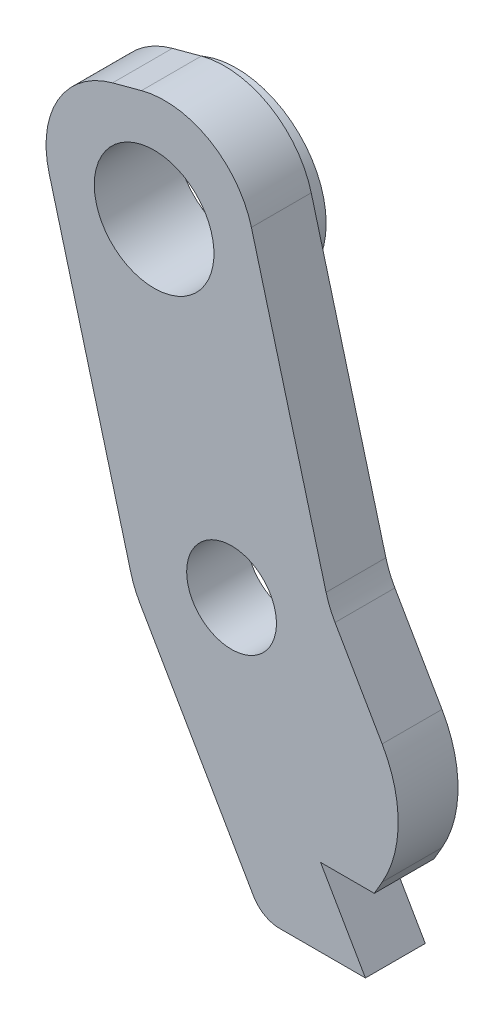
ISO-10303-21;
HEADER;
FILE_DESCRIPTION(('STEP AP214'),'2;1');
FILE_NAME('part.step','',(''),(''),'','','');
FILE_SCHEMA(('AUTOMOTIVE_DESIGN { 1 0 10303 214 1 1 1 1 }'));
ENDSEC;
DATA;
#1=APPLICATION_CONTEXT('core data for automotive mechanical design processes');
#2=APPLICATION_PROTOCOL_DEFINITION('international standard','automotive_design',2000,#1);
#3=PRODUCT_CONTEXT('',#1,'mechanical');
#4=PRODUCT('Part','Part','',(#3));
#5=PRODUCT_RELATED_PRODUCT_CATEGORY('part','',(#4));
#6=PRODUCT_DEFINITION_FORMATION('','',#4);
#7=PRODUCT_DEFINITION_CONTEXT('part definition',#1,'design');
#8=PRODUCT_DEFINITION('design','',#6,#7);
#9=PRODUCT_DEFINITION_SHAPE('','',#8);
#10=(LENGTH_UNIT() NAMED_UNIT(*) SI_UNIT(.MILLI.,.METRE.));
#11=(NAMED_UNIT(*) PLANE_ANGLE_UNIT() SI_UNIT($,.RADIAN.));
#12=(NAMED_UNIT(*) SI_UNIT($,.STERADIAN.) SOLID_ANGLE_UNIT());
#13=UNCERTAINTY_MEASURE_WITH_UNIT(LENGTH_MEASURE(1.E-05),#10,'distance_accuracy_value','');
#14=(GEOMETRIC_REPRESENTATION_CONTEXT(3) GLOBAL_UNCERTAINTY_ASSIGNED_CONTEXT((#13)) GLOBAL_UNIT_ASSIGNED_CONTEXT((#10,
#11,#12)) REPRESENTATION_CONTEXT('',''));
#15=CARTESIAN_POINT('',(0.,0.,0.));
#16=DIRECTION('',(0.,0.,1.));
#17=DIRECTION('',(1.,0.,0.));
#18=AXIS2_PLACEMENT_3D('',#15,#16,#17);
#19=CARTESIAN_POINT('',(0.,0.,-37.2524640543525));
#20=DIRECTION('',(0.,0.,-1.));
#21=DIRECTION('',(-1.,0.,0.));
#22=AXIS2_PLACEMENT_3D('',#19,#20,#21);
#23=PLANE('',#22);
#24=CARTESIAN_POINT('',(-16.5877555472492,18.6593747845128,-37.2524640543525));
#25=DIRECTION('',(0.,0.,-1.));
#26=DIRECTION('',(-1.,0.,0.));
#27=AXIS2_PLACEMENT_3D('',#24,#25,#26);
#28=CIRCLE('',#27,3.00000000000001);
#29=CARTESIAN_POINT('',(-19.5877555472492,18.6593747845128,-37.2524640543525));
#30=VERTEX_POINT('',#29);
#31=EDGE_CURVE('E11',#30,#30,#28,.T.);
#32=ORIENTED_EDGE('',*,*,#31,.F.);
#33=EDGE_LOOP('',(#32));
#34=FACE_BOUND('',#33,.T.);
#35=DIRECTION('',(0.999999998986407,-4.50242804108572E-05,0.));
#36=VECTOR('',#35,1.);
#37=CARTESIAN_POINT('',(-12.9759854417635,0.226354757444194,-37.2524640543525));
#38=LINE('',#37,#36);
#39=CARTESIAN_POINT('',(-12.3986651889558,0.226328764015219,-37.2524640543525));
#40=VERTEX_POINT('',#39);
#41=CARTESIAN_POINT('',(-9.52484687315475,0.226199372413387,-37.2524640543525));
#42=VERTEX_POINT('',#41);
#43=EDGE_CURVE('E151',#40,#42,#38,.T.);
#44=ORIENTED_EDGE('',*,*,#43,.F.);
#45=CARTESIAN_POINT('',(-12.3986201646754,1.22632876300163,-37.2524640543525));
#46=DIRECTION('',(0.,0.,-1.));
#47=DIRECTION('',(-1.,0.,0.));
#48=AXIS2_PLACEMENT_3D('',#45,#46,#47);
#49=CIRCLE('',#48,1.);
#50=CARTESIAN_POINT('',(-13.2646455684599,0.726328763001622,-37.2524640543525));
#51=VERTEX_POINT('',#50);
#52=EDGE_CURVE('E56',#40,#51,#49,.T.);
#53=ORIENTED_EDGE('',*,*,#52,.T.);
#54=DIRECTION('',(0.500000000000005,-0.866025403784436,0.));
#55=VECTOR('',#54,1.);
#56=CARTESIAN_POINT('',(-17.2615208632183,7.64911984504006,-37.2524640543525));
#57=LINE('',#56,#55);
#58=CARTESIAN_POINT('',(-17.0640077632416,7.30701712071999,-37.2524640543525));
#59=VERTEX_POINT('',#58);
#60=EDGE_CURVE('E152',#59,#51,#57,.T.);
#61=ORIENTED_EDGE('',*,*,#60,.F.);
#62=CARTESIAN_POINT('',(-14.4659315518883,8.80701712072,-37.2524640543525));
#63=DIRECTION('',(0.,0.,-1.));
#64=DIRECTION('',(-1.,0.,0.));
#65=AXIS2_PLACEMENT_3D('',#62,#63,#64);
#66=CIRCLE('',#65,3.);
#67=CARTESIAN_POINT('',(-17.3637439872422,8.03069045654523,-37.2524640543525));
#68=VERTEX_POINT('',#67);
#69=EDGE_CURVE('E196',#59,#68,#66,.T.);
#70=ORIENTED_EDGE('',*,*,#69,.T.);
#71=DIRECTION('',(0.258775554724923,-0.965937478451276,0.));
#72=VECTOR('',#71,1.);
#73=CARTESIAN_POINT('',(-20.8742511633659,21.134441517555,-37.2524640543525));
#74=LINE('',#73,#72);
#75=CARTESIAN_POINT('',(-20.0979244991912,18.2366290822012,-37.2524640543525));
#76=VERTEX_POINT('',#75);
#77=EDGE_CURVE('E243',#76,#68,#74,.T.);
#78=ORIENTED_EDGE('',*,*,#77,.F.);
#79=CARTESIAN_POINT('',(-17.2001120638373,19.0129557463759,-37.2524640543525));
#80=DIRECTION('',(0.,0.,-1.));
#81=DIRECTION('',(-1.,0.,0.));
#82=AXIS2_PLACEMENT_3D('',#79,#80,#81);
#83=CIRCLE('',#82,3.);
#84=CARTESIAN_POINT('',(-17.9764387280121,21.9107681817298,-37.2524640543525));
#85=VERTEX_POINT('',#84);
#86=EDGE_CURVE('E192',#76,#85,#83,.T.);
#87=ORIENTED_EDGE('',*,*,#86,.T.);
#88=DIRECTION('',(-0.965937478451276,-0.258775554724923,0.));
#89=VECTOR('',#88,1.);
#90=CARTESIAN_POINT('',(-14.112688814207,22.9458704006295,-37.2524640543525));
#91=LINE('',#90,#89);
#92=CARTESIAN_POINT('',(-17.0105012495608,22.1695437364547,-37.2524640543525));
#93=VERTEX_POINT('',#92);
#94=EDGE_CURVE('E247',#93,#85,#91,.T.);
#95=ORIENTED_EDGE('',*,*,#94,.F.);
#96=CARTESIAN_POINT('',(-16.2341745853861,19.2717313011009,-37.2524640543525));
#97=DIRECTION('',(0.,0.,-1.));
#98=DIRECTION('',(-1.,0.,0.));
#99=AXIS2_PLACEMENT_3D('',#96,#97,#98);
#100=CIRCLE('',#99,3.);
#101=CARTESIAN_POINT('',(-13.3363621500322,20.0480579652756,-37.2524640543525));
#102=VERTEX_POINT('',#101);
#103=EDGE_CURVE('E194',#93,#102,#100,.T.);
#104=ORIENTED_EDGE('',*,*,#103,.T.);
#105=DIRECTION('',(-0.258775554724922,0.965937478451276,0.));
#106=VECTOR('',#105,1.);
#107=CARTESIAN_POINT('',(-10.7384791367817,10.3508801549599,-37.2524640543525));
#108=LINE('',#107,#106);
#109=CARTESIAN_POINT('',(-10.8407022608055,10.7324507664651,-37.2524640543525));
#110=VERTEX_POINT('',#109);
#111=EDGE_CURVE('E251',#110,#102,#108,.T.);
#112=ORIENTED_EDGE('',*,*,#111,.F.);
#113=CARTESIAN_POINT('',(-7.94288982545166,11.5087774306399,-37.2524640543525));
#114=DIRECTION('',(0.,0.,-1.));
#115=DIRECTION('',(-1.,0.,0.));
#116=AXIS2_PLACEMENT_3D('',#113,#114,#115);
#117=CIRCLE('',#116,3.);
#118=CARTESIAN_POINT('',(-10.540966036805,10.0087774306399,-37.2524640543525));
#119=VERTEX_POINT('',#118);
#120=EDGE_CURVE('E215',#110,#119,#117,.F.);
#121=ORIENTED_EDGE('',*,*,#120,.T.);
#122=DIRECTION('',(-0.500000000000005,0.866025403784436,0.));
#123=VECTOR('',#122,1.);
#124=CARTESIAN_POINT('',(-10.7384791367817,10.3508801549599,-37.2524640543525));
#125=LINE('',#124,#123);
#126=CARTESIAN_POINT('',(-8.96600649593849,7.28086748599382,-37.2524640543525));
#127=VERTEX_POINT('',#126);
#128=EDGE_CURVE('E255',#127,#119,#125,.T.);
#129=ORIENTED_EDGE('',*,*,#128,.F.);
#130=CARTESIAN_POINT('',(-12.4301081110762,5.2808674859938,-37.2524640543525));
#131=DIRECTION('',(0.,0.,-1.));
#132=DIRECTION('',(-1.,0.,0.));
#133=AXIS2_PLACEMENT_3D('',#130,#131,#132);
#134=CIRCLE('',#133,4.);
#135=CARTESIAN_POINT('',(-8.96600649593849,3.28086748599378,-37.2524640543525));
#136=VERTEX_POINT('',#135);
#137=EDGE_CURVE('E223',#127,#136,#134,.T.);
#138=ORIENTED_EDGE('',*,*,#137,.T.);
#139=DIRECTION('',(0.500000000000004,0.866025403784436,0.));
#140=VECTOR('',#139,1.);
#141=CARTESIAN_POINT('',(-7.81130595755921,5.2808674859938,-37.2524640543525));
#142=LINE('',#141,#140);
#143=CARTESIAN_POINT('',(-9.2296199535991,2.8242755837667,-37.2524640543525));
#144=VERTEX_POINT('',#143);
#145=EDGE_CURVE('E182',#144,#136,#142,.T.);
#146=ORIENTED_EDGE('',*,*,#145,.F.);
#147=DIRECTION('',(1.,0.,0.));
#148=VECTOR('',#147,1.);
#149=CARTESIAN_POINT('',(-11.0248468731548,2.8242755837667,-37.2524640543525));
#150=LINE('',#149,#148);
#151=CARTESIAN_POINT('',(-11.0248468731548,2.8242755837667,-37.2524640543525));
#152=VERTEX_POINT('',#151);
#153=EDGE_CURVE('E174',#152,#144,#150,.T.);
#154=ORIENTED_EDGE('',*,*,#153,.F.);
#155=DIRECTION('',(-0.500000000000004,0.866025403784436,0.));
#156=VECTOR('',#155,1.);
#157=CARTESIAN_POINT('',(-9.52484687315475,0.226199372413387,-37.2524640543525));
#158=LINE('',#157,#156);
#159=EDGE_CURVE('E160',#42,#152,#158,.T.);
#160=ORIENTED_EDGE('',*,*,#159,.F.);
#161=EDGE_LOOP('',(#44,#53,#61,#70,#78,#87,#95,#104,#112,#121,#129,#138,#146,#154,#160));
#162=FACE_BOUND('',#161,.T.);
#163=CARTESIAN_POINT('',(-14.,9.,-37.2524640543525));
#164=DIRECTION('',(0.,0.,1.));
#165=DIRECTION('',(0.,-1.,0.));
#166=AXIS2_PLACEMENT_3D('',#163,#164,#165);
#167=CIRCLE('',#166,1.5);
#168=CARTESIAN_POINT('',(-14.,7.5,-37.2524640543525));
#169=VERTEX_POINT('',#168);
#170=EDGE_CURVE('E258',#169,#169,#167,.T.);
#171=ORIENTED_EDGE('',*,*,#170,.T.);
#172=EDGE_LOOP('',(#171));
#173=FACE_BOUND('',#172,.T.);
#174=ADVANCED_FACE('F33',(#34,#162,#173),#23,.T.);
#175=CARTESIAN_POINT('',(-10.7384791367817,10.3508801549599,-9.04513704299428));
#176=DIRECTION('',(-0.866025403784436,-0.500000000000005,0.));
#177=DIRECTION('',(0.500000000000005,-0.866025403784436,0.));
#178=AXIS2_PLACEMENT_3D('',#175,#176,#177);
#179=PLANE('',#178);
#180=DIRECTION('',(0.500000000000005,-0.866025403784436,0.));
#181=VECTOR('',#180,1.);
#182=CARTESIAN_POINT('',(-10.7384791367817,10.3508801549599,-35.2524640543526));
#183=LINE('',#182,#181);
#184=CARTESIAN_POINT('',(-10.540966036805,10.0087774306399,-35.2524640543526));
#185=VERTEX_POINT('',#184);
#186=CARTESIAN_POINT('',(-8.96600649593849,7.28086748599382,-35.2524640543526));
#187=VERTEX_POINT('',#186);
#188=EDGE_CURVE('E257',#185,#187,#183,.T.);
#189=ORIENTED_EDGE('',*,*,#188,.T.);
#190=DIRECTION('',(0.,0.,-1.));
#191=VECTOR('',#190,1.);
#192=CARTESIAN_POINT('',(-8.96600649593849,7.28086748599382,-9.04513704299428));
#193=LINE('',#192,#191);
#194=EDGE_CURVE('E220',#187,#127,#193,.T.);
#195=ORIENTED_EDGE('',*,*,#194,.T.);
#196=ORIENTED_EDGE('',*,*,#128,.T.);
#197=DIRECTION('',(0.,0.,-1.));
#198=VECTOR('',#197,1.);
#199=CARTESIAN_POINT('',(-10.540966036805,10.0087774306399,-35.2524640543526));
#200=LINE('',#199,#198);
#201=EDGE_CURVE('E187',#119,#185,#200,.F.);
#202=ORIENTED_EDGE('',*,*,#201,.T.);
#203=EDGE_LOOP('',(#189,#195,#196,#202));
#204=FACE_BOUND('',#203,.T.);
#205=ADVANCED_FACE('F307',(#204),#179,.F.);
#206=CARTESIAN_POINT('',(-10.7384791367817,10.3508801549599,-9.04513704299428));
#207=DIRECTION('',(-0.965937478451276,-0.258775554724922,0.));
#208=DIRECTION('',(0.258775554724922,-0.965937478451276,0.));
#209=AXIS2_PLACEMENT_3D('',#206,#207,#208);
#210=PLANE('',#209);
#211=DIRECTION('',(0.258775554724922,-0.965937478451276,0.));
#212=VECTOR('',#211,1.);
#213=CARTESIAN_POINT('',(-10.7384791367817,10.3508801549599,-35.2524640543526));
#214=LINE('',#213,#212);
#215=CARTESIAN_POINT('',(-13.3363621500322,20.0480579652756,-35.2524640543526));
#216=VERTEX_POINT('',#215);
#217=CARTESIAN_POINT('',(-10.8407022608055,10.7324507664651,-35.2524640543526));
#218=VERTEX_POINT('',#217);
#219=EDGE_CURVE('E254',#216,#218,#214,.T.);
#220=ORIENTED_EDGE('',*,*,#219,.T.);
#221=DIRECTION('',(0.,0.,-1.));
#222=VECTOR('',#221,1.);
#223=CARTESIAN_POINT('',(-10.8407022608055,10.7324507664651,-37.2524640543525));
#224=LINE('',#223,#222);
#225=EDGE_CURVE('E184',#218,#110,#224,.T.);
#226=ORIENTED_EDGE('',*,*,#225,.T.);
#227=ORIENTED_EDGE('',*,*,#111,.T.);
#228=DIRECTION('',(0.,0.,-1.));
#229=VECTOR('',#228,1.);
#230=CARTESIAN_POINT('',(-13.3363621500322,20.0480579652756,-9.04513704299428));
#231=LINE('',#230,#229);
#232=EDGE_CURVE('E178',#102,#216,#231,.F.);
#233=ORIENTED_EDGE('',*,*,#232,.T.);
#234=EDGE_LOOP('',(#220,#226,#227,#233));
#235=FACE_BOUND('',#234,.T.);
#236=ADVANCED_FACE('F297',(#235),#210,.F.);
#237=CARTESIAN_POINT('',(-14.112688814207,22.9458704006295,-9.04513704299428));
#238=DIRECTION('',(0.258775554724923,-0.965937478451276,0.));
#239=DIRECTION('',(0.965937478451276,0.258775554724923,0.));
#240=AXIS2_PLACEMENT_3D('',#237,#238,#239);
#241=PLANE('',#240);
#242=DIRECTION('',(0.965937478451276,0.258775554724923,0.));
#243=VECTOR('',#242,1.);
#244=CARTESIAN_POINT('',(-14.112688814207,22.9458704006295,-35.2524640543526));
#245=LINE('',#244,#243);
#246=CARTESIAN_POINT('',(-17.9764387280121,21.9107681817298,-35.2524640543526));
#247=VERTEX_POINT('',#246);
#248=CARTESIAN_POINT('',(-17.0105012495608,22.1695437364547,-35.2524640543526));
#249=VERTEX_POINT('',#248);
#250=EDGE_CURVE('E250',#247,#249,#245,.T.);
#251=ORIENTED_EDGE('',*,*,#250,.T.);
#252=DIRECTION('',(0.,0.,-1.));
#253=VECTOR('',#252,1.);
#254=CARTESIAN_POINT('',(-17.0105012495608,22.1695437364547,-9.04513704299428));
#255=LINE('',#254,#253);
#256=EDGE_CURVE('E212',#249,#93,#255,.T.);
#257=ORIENTED_EDGE('',*,*,#256,.T.);
#258=ORIENTED_EDGE('',*,*,#94,.T.);
#259=DIRECTION('',(0.,0.,-1.));
#260=VECTOR('',#259,1.);
#261=CARTESIAN_POINT('',(-17.9764387280121,21.9107681817298,-9.04513704299428));
#262=LINE('',#261,#260);
#263=EDGE_CURVE('E210',#85,#247,#262,.F.);
#264=ORIENTED_EDGE('',*,*,#263,.T.);
#265=EDGE_LOOP('',(#251,#257,#258,#264));
#266=FACE_BOUND('',#265,.T.);
#267=ADVANCED_FACE('F288',(#266),#241,.F.);
#268=CARTESIAN_POINT('',(-20.8742511633659,21.134441517555,-9.04513704299428));
#269=DIRECTION('',(0.965937478451276,0.258775554724923,0.));
#270=DIRECTION('',(-0.258775554724923,0.965937478451276,0.));
#271=AXIS2_PLACEMENT_3D('',#268,#269,#270);
#272=PLANE('',#271);
#273=ORIENTED_EDGE('',*,*,#77,.T.);
#274=DIRECTION('',(0.,0.,-1.));
#275=VECTOR('',#274,1.);
#276=CARTESIAN_POINT('',(-17.3637439872422,8.03069045654524,-9.04513704299428));
#277=LINE('',#276,#275);
#278=CARTESIAN_POINT('',(-17.3637439872422,8.03069045654524,-35.2524640543526));
#279=VERTEX_POINT('',#278);
#280=EDGE_CURVE('E201',#68,#279,#277,.F.);
#281=ORIENTED_EDGE('',*,*,#280,.T.);
#282=DIRECTION('',(-0.258775554724923,0.965937478451276,0.));
#283=VECTOR('',#282,1.);
#284=CARTESIAN_POINT('',(-20.8742511633659,21.134441517555,-35.2524640543526));
#285=LINE('',#284,#283);
#286=CARTESIAN_POINT('',(-20.0979244991912,18.2366290822012,-35.2524640543526));
#287=VERTEX_POINT('',#286);
#288=EDGE_CURVE('E246',#279,#287,#285,.T.);
#289=ORIENTED_EDGE('',*,*,#288,.T.);
#290=DIRECTION('',(0.,0.,-1.));
#291=VECTOR('',#290,1.);
#292=CARTESIAN_POINT('',(-20.0979244991912,18.2366290822012,-9.04513704299428));
#293=LINE('',#292,#291);
#294=EDGE_CURVE('E198',#287,#76,#293,.T.);
#295=ORIENTED_EDGE('',*,*,#294,.T.);
#296=EDGE_LOOP('',(#273,#281,#289,#295));
#297=FACE_BOUND('',#296,.T.);
#298=ADVANCED_FACE('F280',(#297),#272,.F.);
#299=CARTESIAN_POINT('',(-17.2615208632183,7.64911984504006,-9.04513704299428));
#300=DIRECTION('',(0.866025403784436,0.500000000000005,0.));
#301=DIRECTION('',(-0.500000000000005,0.866025403784436,0.));
#302=AXIS2_PLACEMENT_3D('',#299,#300,#301);
#303=PLANE('',#302);
#304=ORIENTED_EDGE('',*,*,#60,.T.);
#305=DIRECTION('',(0.,0.,-1.));
#306=VECTOR('',#305,1.);
#307=CARTESIAN_POINT('',(-13.2646455684599,0.726328763001622,-9.04513704299428));
#308=LINE('',#307,#306);
#309=CARTESIAN_POINT('',(-13.2646455684599,0.726328763001622,-35.2524640543526));
#310=VERTEX_POINT('',#309);
#311=EDGE_CURVE('E48',#51,#310,#308,.F.);
#312=ORIENTED_EDGE('',*,*,#311,.T.);
#313=DIRECTION('',(-0.500000000000005,0.866025403784436,0.));
#314=VECTOR('',#313,1.);
#315=CARTESIAN_POINT('',(-17.2615208632183,7.64911984504006,-35.2524640543526));
#316=LINE('',#315,#314);
#317=CARTESIAN_POINT('',(-17.0640077632416,7.30701712071999,-35.2524640543526));
#318=VERTEX_POINT('',#317);
#319=EDGE_CURVE('E242',#310,#318,#316,.T.);
#320=ORIENTED_EDGE('',*,*,#319,.T.);
#321=DIRECTION('',(0.,0.,-1.));
#322=VECTOR('',#321,1.);
#323=CARTESIAN_POINT('',(-17.0640077632416,7.30701712071999,-9.04513704299428));
#324=LINE('',#323,#322);
#325=EDGE_CURVE('E189',#318,#59,#324,.T.);
#326=ORIENTED_EDGE('',*,*,#325,.T.);
#327=EDGE_LOOP('',(#304,#312,#320,#326));
#328=FACE_BOUND('',#327,.T.);
#329=ADVANCED_FACE('F271',(#328),#303,.F.);
#330=CARTESIAN_POINT('',(-12.9759854417635,0.226354757444194,-9.04513704299428));
#331=DIRECTION('',(4.50242804108572E-05,0.999999998986407,0.));
#332=DIRECTION('',(-0.999999998986407,4.50242804108572E-05,0.));
#333=AXIS2_PLACEMENT_3D('',#330,#331,#332);
#334=PLANE('',#333);
#335=DIRECTION('',(-0.999999998986407,4.50242804108572E-05,0.));
#336=VECTOR('',#335,1.);
#337=CARTESIAN_POINT('',(-12.9759854417635,0.226354757444194,-35.2524640543526));
#338=LINE('',#337,#336);
#339=CARTESIAN_POINT('',(-9.52484687315475,0.226199372413387,-35.2524640543526));
#340=VERTEX_POINT('',#339);
#341=CARTESIAN_POINT('',(-12.3986651889558,0.226328764015219,-35.2524640543526));
#342=VERTEX_POINT('',#341);
#343=EDGE_CURVE('E140',#340,#342,#338,.T.);
#344=ORIENTED_EDGE('',*,*,#343,.T.);
#345=DIRECTION('',(0.,0.,-1.));
#346=VECTOR('',#345,1.);
#347=CARTESIAN_POINT('',(-12.3986651889558,0.226328764015219,-9.04513704299428));
#348=LINE('',#347,#346);
#349=EDGE_CURVE('E229',#342,#40,#348,.T.);
#350=ORIENTED_EDGE('',*,*,#349,.T.);
#351=ORIENTED_EDGE('',*,*,#43,.T.);
#352=DIRECTION('',(0.,0.,-1.));
#353=VECTOR('',#352,1.);
#354=CARTESIAN_POINT('',(-9.52484687315475,0.226199372413387,-9.04513704299428));
#355=LINE('',#354,#353);
#356=EDGE_CURVE('E155',#340,#42,#355,.T.);
#357=ORIENTED_EDGE('',*,*,#356,.F.);
#358=EDGE_LOOP('',(#344,#350,#351,#357));
#359=FACE_BOUND('',#358,.T.);
#360=ADVANCED_FACE('F156',(#359),#334,.F.);
#361=CARTESIAN_POINT('',(-9.52484687315475,0.226199372413387,-9.04513704299428));
#362=DIRECTION('',(-0.866025403784436,-0.500000000000004,0.));
#363=DIRECTION('',(0.500000000000004,-0.866025403784436,0.));
#364=AXIS2_PLACEMENT_3D('',#361,#362,#363);
#365=PLANE('',#364);
#366=DIRECTION('',(0.,0.,-1.));
#367=VECTOR('',#366,1.);
#368=CARTESIAN_POINT('',(-11.0248468731548,2.8242755837667,-9.04513704299428));
#369=LINE('',#368,#367);
#370=CARTESIAN_POINT('',(-11.0248468731548,2.8242755837667,-35.2524640543526));
#371=VERTEX_POINT('',#370);
#372=EDGE_CURVE('E163',#371,#152,#369,.T.);
#373=ORIENTED_EDGE('',*,*,#372,.F.);
#374=DIRECTION('',(0.500000000000004,-0.866025403784436,0.));
#375=VECTOR('',#374,1.);
#376=CARTESIAN_POINT('',(-9.52484687315475,0.226199372413387,-35.2524640543526));
#377=LINE('',#376,#375);
#378=EDGE_CURVE('E145',#371,#340,#377,.T.);
#379=ORIENTED_EDGE('',*,*,#378,.T.);
#380=ORIENTED_EDGE('',*,*,#356,.T.);
#381=ORIENTED_EDGE('',*,*,#159,.T.);
#382=EDGE_LOOP('',(#373,#379,#380,#381));
#383=FACE_BOUND('',#382,.T.);
#384=ADVANCED_FACE('F162',(#383),#365,.F.);
#385=CARTESIAN_POINT('',(-11.0248468731548,2.8242755837667,-9.04513704299428));
#386=DIRECTION('',(0.,1.,0.));
#387=DIRECTION('',(0.,0.,1.));
#388=AXIS2_PLACEMENT_3D('',#385,#386,#387);
#389=PLANE('',#388);
#390=DIRECTION('',(0.,0.,-1.));
#391=VECTOR('',#390,1.);
#392=CARTESIAN_POINT('',(-9.2296199535991,2.8242755837667,-9.04513704299428));
#393=LINE('',#392,#391);
#394=CARTESIAN_POINT('',(-9.2296199535991,2.8242755837667,-35.2524640543526));
#395=VERTEX_POINT('',#394);
#396=EDGE_CURVE('E173',#395,#144,#393,.T.);
#397=ORIENTED_EDGE('',*,*,#396,.F.);
#398=DIRECTION('',(-1.,0.,0.));
#399=VECTOR('',#398,1.);
#400=CARTESIAN_POINT('',(-11.0248468731548,2.8242755837667,-35.2524640543526));
#401=LINE('',#400,#399);
#402=EDGE_CURVE('E169',#395,#371,#401,.T.);
#403=ORIENTED_EDGE('',*,*,#402,.T.);
#404=ORIENTED_EDGE('',*,*,#372,.T.);
#405=ORIENTED_EDGE('',*,*,#153,.T.);
#406=EDGE_LOOP('',(#397,#403,#404,#405));
#407=FACE_BOUND('',#406,.T.);
#408=ADVANCED_FACE('F319',(#407),#389,.F.);
#409=CARTESIAN_POINT('',(-7.81130595755921,5.2808674859938,-9.04513704299428));
#410=DIRECTION('',(-0.866025403784436,0.500000000000004,0.));
#411=DIRECTION('',(-0.500000000000004,-0.866025403784436,0.));
#412=AXIS2_PLACEMENT_3D('',#409,#410,#411);
#413=PLANE('',#412);
#414=ORIENTED_EDGE('',*,*,#145,.T.);
#415=DIRECTION('',(0.,0.,-1.));
#416=VECTOR('',#415,1.);
#417=CARTESIAN_POINT('',(-8.96600649593849,3.28086748599378,-9.04513704299428));
#418=LINE('',#417,#416);
#419=CARTESIAN_POINT('',(-8.96600649593849,3.28086748599378,-35.2524640543526));
#420=VERTEX_POINT('',#419);
#421=EDGE_CURVE('E225',#136,#420,#418,.F.);
#422=ORIENTED_EDGE('',*,*,#421,.T.);
#423=DIRECTION('',(-0.500000000000004,-0.866025403784436,0.));
#424=VECTOR('',#423,1.);
#425=CARTESIAN_POINT('',(-7.81130595755921,5.2808674859938,-35.2524640543526));
#426=LINE('',#425,#424);
#427=EDGE_CURVE('E171',#420,#395,#426,.T.);
#428=ORIENTED_EDGE('',*,*,#427,.T.);
#429=ORIENTED_EDGE('',*,*,#396,.T.);
#430=EDGE_LOOP('',(#414,#422,#428,#429));
#431=FACE_BOUND('',#430,.T.);
#432=ADVANCED_FACE('F316',(#431),#413,.F.);
#433=CARTESIAN_POINT('',(-16.5877555472492,18.6593747845128,-9.04513704299428));
#434=DIRECTION('',(0.,0.,-1.));
#435=DIRECTION('',(0.,1.,0.));
#436=AXIS2_PLACEMENT_3D('',#433,#434,#435);
#437=CYLINDRICAL_SURFACE('',#436,2.);
#438=CARTESIAN_POINT('',(-16.5877555472492,18.6593747845128,-35.2524640543526));
#439=DIRECTION('',(0.,0.,-1.));
#440=DIRECTION('',(-1.,0.,0.));
#441=AXIS2_PLACEMENT_3D('',#438,#439,#440);
#442=CIRCLE('',#441,2.);
#443=CARTESIAN_POINT('',(-18.5877555472492,18.6593747845128,-35.2524640543526));
#444=VERTEX_POINT('',#443);
#445=EDGE_CURVE('E175',#444,#444,#442,.T.);
#446=ORIENTED_EDGE('',*,*,#445,.F.);
#447=EDGE_LOOP('',(#446));
#448=FACE_BOUND('',#447,.T.);
#449=CARTESIAN_POINT('',(-16.5877555472492,18.6593747845128,-38.0024640543525));
#450=DIRECTION('',(0.,0.,1.));
#451=DIRECTION('',(1.,0.,0.));
#452=AXIS2_PLACEMENT_3D('',#449,#450,#451);
#453=CIRCLE('',#452,2.);
#454=CARTESIAN_POINT('',(-14.5877555472492,18.6593747845128,-38.0024640543525));
#455=VERTEX_POINT('',#454);
#456=EDGE_CURVE('E323',#455,#455,#453,.T.);
#457=ORIENTED_EDGE('',*,*,#456,.F.);
#458=EDGE_LOOP('',(#457));
#459=FACE_BOUND('',#458,.T.);
#460=ADVANCED_FACE('F330',(#448,#459),#437,.F.);
#461=CARTESIAN_POINT('',(-14.,9.,-9.04513704299428));
#462=DIRECTION('',(0.,0.,-1.));
#463=DIRECTION('',(0.,1.,0.));
#464=AXIS2_PLACEMENT_3D('',#461,#462,#463);
#465=CYLINDRICAL_SURFACE('',#464,1.5);
#466=CARTESIAN_POINT('',(-14.,9.,-35.2524640543526));
#467=DIRECTION('',(0.,0.,-1.));
#468=DIRECTION('',(-1.,0.,0.));
#469=AXIS2_PLACEMENT_3D('',#466,#467,#468);
#470=CIRCLE('',#469,1.5);
#471=CARTESIAN_POINT('',(-15.5,9.,-35.2524640543526));
#472=VERTEX_POINT('',#471);
#473=EDGE_CURVE('E179',#472,#472,#470,.T.);
#474=ORIENTED_EDGE('',*,*,#473,.F.);
#475=EDGE_LOOP('',(#474));
#476=FACE_BOUND('',#475,.T.);
#477=ORIENTED_EDGE('',*,*,#170,.F.);
#478=EDGE_LOOP('',(#477));
#479=FACE_BOUND('',#478,.T.);
#480=ADVANCED_FACE('F332',(#476,#479),#465,.F.);
#481=CARTESIAN_POINT('',(0.,0.,-35.2524640543526));
#482=DIRECTION('',(0.,0.,-1.));
#483=DIRECTION('',(-1.,0.,0.));
#484=AXIS2_PLACEMENT_3D('',#481,#482,#483);
#485=PLANE('',#484);
#486=ORIENTED_EDGE('',*,*,#473,.T.);
#487=EDGE_LOOP('',(#486));
#488=FACE_BOUND('',#487,.T.);
#489=ORIENTED_EDGE('',*,*,#445,.T.);
#490=EDGE_LOOP('',(#489));
#491=FACE_BOUND('',#490,.T.);
#492=ORIENTED_EDGE('',*,*,#319,.F.);
#493=CARTESIAN_POINT('',(-12.3986201646754,1.22632876300163,-35.2524640543526));
#494=DIRECTION('',(0.,0.,-1.));
#495=DIRECTION('',(-1.,0.,0.));
#496=AXIS2_PLACEMENT_3D('',#493,#494,#495);
#497=CIRCLE('',#496,1.);
#498=EDGE_CURVE('E41',#310,#342,#497,.F.);
#499=ORIENTED_EDGE('',*,*,#498,.T.);
#500=ORIENTED_EDGE('',*,*,#343,.F.);
#501=ORIENTED_EDGE('',*,*,#378,.F.);
#502=ORIENTED_EDGE('',*,*,#402,.F.);
#503=ORIENTED_EDGE('',*,*,#427,.F.);
#504=CARTESIAN_POINT('',(-12.4301081110762,5.2808674859938,-35.2524640543526));
#505=DIRECTION('',(0.,0.,-1.));
#506=DIRECTION('',(-1.,0.,0.));
#507=AXIS2_PLACEMENT_3D('',#504,#505,#506);
#508=CIRCLE('',#507,4.);
#509=EDGE_CURVE('E227',#420,#187,#508,.F.);
#510=ORIENTED_EDGE('',*,*,#509,.T.);
#511=ORIENTED_EDGE('',*,*,#188,.F.);
#512=CARTESIAN_POINT('',(-7.94288982545166,11.5087774306399,-35.2524640543526));
#513=DIRECTION('',(0.,0.,-1.));
#514=DIRECTION('',(-1.,0.,0.));
#515=AXIS2_PLACEMENT_3D('',#512,#513,#514);
#516=CIRCLE('',#515,3.);
#517=EDGE_CURVE('E218',#185,#218,#516,.T.);
#518=ORIENTED_EDGE('',*,*,#517,.T.);
#519=ORIENTED_EDGE('',*,*,#219,.F.);
#520=CARTESIAN_POINT('',(-16.2341745853861,19.2717313011009,-35.2524640543526));
#521=DIRECTION('',(0.,0.,-1.));
#522=DIRECTION('',(-1.,0.,0.));
#523=AXIS2_PLACEMENT_3D('',#520,#521,#522);
#524=CIRCLE('',#523,3.);
#525=EDGE_CURVE('E205',#216,#249,#524,.F.);
#526=ORIENTED_EDGE('',*,*,#525,.T.);
#527=ORIENTED_EDGE('',*,*,#250,.F.);
#528=CARTESIAN_POINT('',(-17.2001120638373,19.0129557463759,-35.2524640543526));
#529=DIRECTION('',(0.,0.,-1.));
#530=DIRECTION('',(-1.,0.,0.));
#531=AXIS2_PLACEMENT_3D('',#528,#529,#530);
#532=CIRCLE('',#531,3.);
#533=EDGE_CURVE('E203',#247,#287,#532,.F.);
#534=ORIENTED_EDGE('',*,*,#533,.T.);
#535=ORIENTED_EDGE('',*,*,#288,.F.);
#536=CARTESIAN_POINT('',(-14.4659315518883,8.80701712072,-35.2524640543526));
#537=DIRECTION('',(0.,0.,-1.));
#538=DIRECTION('',(-1.,0.,0.));
#539=AXIS2_PLACEMENT_3D('',#536,#537,#538);
#540=CIRCLE('',#539,3.);
#541=EDGE_CURVE('E207',#279,#318,#540,.F.);
#542=ORIENTED_EDGE('',*,*,#541,.T.);
#543=EDGE_LOOP('',(#492,#499,#500,#501,#502,#503,#510,#511,#518,#519,#526,#527,#534,#535,#542));
#544=FACE_BOUND('',#543,.T.);
#545=ADVANCED_FACE('F142',(#488,#491,#544),#485,.F.);
#546=CARTESIAN_POINT('',(-7.94288982545166,11.5087774306399,-9.04513704299428));
#547=DIRECTION('',(0.,0.,1.));
#548=DIRECTION('',(0.,-1.,0.));
#549=AXIS2_PLACEMENT_3D('',#546,#547,#548);
#550=CYLINDRICAL_SURFACE('',#549,3.);
#551=ORIENTED_EDGE('',*,*,#517,.F.);
#552=ORIENTED_EDGE('',*,*,#201,.F.);
#553=ORIENTED_EDGE('',*,*,#120,.F.);
#554=ORIENTED_EDGE('',*,*,#225,.F.);
#555=EDGE_LOOP('',(#551,#552,#553,#554));
#556=FACE_BOUND('',#555,.T.);
#557=ADVANCED_FACE('F302',(#556),#550,.F.);
#558=CARTESIAN_POINT('',(-14.4659315518883,8.80701712072,-9.04513704299428));
#559=DIRECTION('',(0.,0.,-1.));
#560=DIRECTION('',(0.,1.,0.));
#561=AXIS2_PLACEMENT_3D('',#558,#559,#560);
#562=CYLINDRICAL_SURFACE('',#561,3.);
#563=ORIENTED_EDGE('',*,*,#541,.F.);
#564=ORIENTED_EDGE('',*,*,#280,.F.);
#565=ORIENTED_EDGE('',*,*,#69,.F.);
#566=ORIENTED_EDGE('',*,*,#325,.F.);
#567=EDGE_LOOP('',(#563,#564,#565,#566));
#568=FACE_BOUND('',#567,.T.);
#569=ADVANCED_FACE('F277',(#568),#562,.T.);
#570=CARTESIAN_POINT('',(-16.2341745853861,19.2717313011009,-9.04513704299428));
#571=DIRECTION('',(0.,0.,-1.));
#572=DIRECTION('',(0.,1.,0.));
#573=AXIS2_PLACEMENT_3D('',#570,#571,#572);
#574=CYLINDRICAL_SURFACE('',#573,3.);
#575=ORIENTED_EDGE('',*,*,#525,.F.);
#576=ORIENTED_EDGE('',*,*,#232,.F.);
#577=ORIENTED_EDGE('',*,*,#103,.F.);
#578=ORIENTED_EDGE('',*,*,#256,.F.);
#579=EDGE_LOOP('',(#575,#576,#577,#578));
#580=FACE_BOUND('',#579,.T.);
#581=ADVANCED_FACE('F293',(#580),#574,.T.);
#582=CARTESIAN_POINT('',(-17.2001120638373,19.0129557463759,-9.04513704299428));
#583=DIRECTION('',(0.,0.,-1.));
#584=DIRECTION('',(0.,1.,0.));
#585=AXIS2_PLACEMENT_3D('',#582,#583,#584);
#586=CYLINDRICAL_SURFACE('',#585,3.);
#587=ORIENTED_EDGE('',*,*,#533,.F.);
#588=ORIENTED_EDGE('',*,*,#263,.F.);
#589=ORIENTED_EDGE('',*,*,#86,.F.);
#590=ORIENTED_EDGE('',*,*,#294,.F.);
#591=EDGE_LOOP('',(#587,#588,#589,#590));
#592=FACE_BOUND('',#591,.T.);
#593=ADVANCED_FACE('F284',(#592),#586,.T.);
#594=CARTESIAN_POINT('',(-12.4301081110762,5.2808674859938,-9.04513704299428));
#595=DIRECTION('',(0.,0.,-1.));
#596=DIRECTION('',(0.,1.,0.));
#597=AXIS2_PLACEMENT_3D('',#594,#595,#596);
#598=CYLINDRICAL_SURFACE('',#597,4.);
#599=ORIENTED_EDGE('',*,*,#509,.F.);
#600=ORIENTED_EDGE('',*,*,#421,.F.);
#601=ORIENTED_EDGE('',*,*,#137,.F.);
#602=ORIENTED_EDGE('',*,*,#194,.F.);
#603=EDGE_LOOP('',(#599,#600,#601,#602));
#604=FACE_BOUND('',#603,.T.);
#605=ADVANCED_FACE('F312',(#604),#598,.T.);
#606=CARTESIAN_POINT('',(-12.3986201646754,1.22632876300163,-9.04513704299428));
#607=DIRECTION('',(0.,0.,-1.));
#608=DIRECTION('',(0.,1.,0.));
#609=AXIS2_PLACEMENT_3D('',#606,#607,#608);
#610=CYLINDRICAL_SURFACE('',#609,1.);
#611=ORIENTED_EDGE('',*,*,#498,.F.);
#612=ORIENTED_EDGE('',*,*,#311,.F.);
#613=ORIENTED_EDGE('',*,*,#52,.F.);
#614=ORIENTED_EDGE('',*,*,#349,.F.);
#615=EDGE_LOOP('',(#611,#612,#613,#614));
#616=FACE_BOUND('',#615,.T.);
#617=ADVANCED_FACE('F35',(#616),#610,.T.);
#618=CARTESIAN_POINT('',(-16.5877555472492,18.6593747845128,-38.0024640543525));
#619=DIRECTION('',(0.,0.,1.));
#620=DIRECTION('',(1.,0.,0.));
#621=AXIS2_PLACEMENT_3D('',#618,#619,#620);
#622=CYLINDRICAL_SURFACE('',#621,3.00000000000001);
#623=CARTESIAN_POINT('',(-16.5877555472492,18.6593747845128,-38.0024640543525));
#624=DIRECTION('',(0.,0.,1.));
#625=DIRECTION('',(1.,0.,0.));
#626=AXIS2_PLACEMENT_3D('',#623,#624,#625);
#627=CIRCLE('',#626,3.00000000000001);
#628=CARTESIAN_POINT('',(-13.5877555472492,18.6593747845128,-38.0024640543525));
#629=VERTEX_POINT('',#628);
#630=EDGE_CURVE('E260',#629,#629,#627,.T.);
#631=ORIENTED_EDGE('',*,*,#630,.T.);
#632=EDGE_LOOP('',(#631));
#633=FACE_BOUND('',#632,.T.);
#634=ORIENTED_EDGE('',*,*,#31,.T.);
#635=EDGE_LOOP('',(#634));
#636=FACE_BOUND('',#635,.T.);
#637=ADVANCED_FACE('F352',(#633,#636),#622,.T.);
#638=CARTESIAN_POINT('',(-16.5877555472492,18.6593747845128,-38.0024640543525));
#639=DIRECTION('',(0.,0.,1.));
#640=DIRECTION('',(1.,0.,0.));
#641=AXIS2_PLACEMENT_3D('',#638,#639,#640);
#642=PLANE('',#641);
#643=ORIENTED_EDGE('',*,*,#456,.T.);
#644=EDGE_LOOP('',(#643));
#645=FACE_BOUND('',#644,.T.);
#646=ORIENTED_EDGE('',*,*,#630,.F.);
#647=EDGE_LOOP('',(#646));
#648=FACE_BOUND('',#647,.T.);
#649=ADVANCED_FACE('F327',(#645,#648),#642,.F.);
#650=CLOSED_SHELL('',(#174,#205,#236,#267,#298,#329,#360,#384,#408,#432,#460,#480,#545,#557,
#569,#581,#593,#605,#617,#637,#649));
#651=MANIFOLD_SOLID_BREP('B2',#650);
#652=ADVANCED_BREP_SHAPE_REPRESENTATION('',(#18,#651),#14);
#653=SHAPE_DEFINITION_REPRESENTATION(#9,#652);
ENDSEC;
END-ISO-10303-21;
